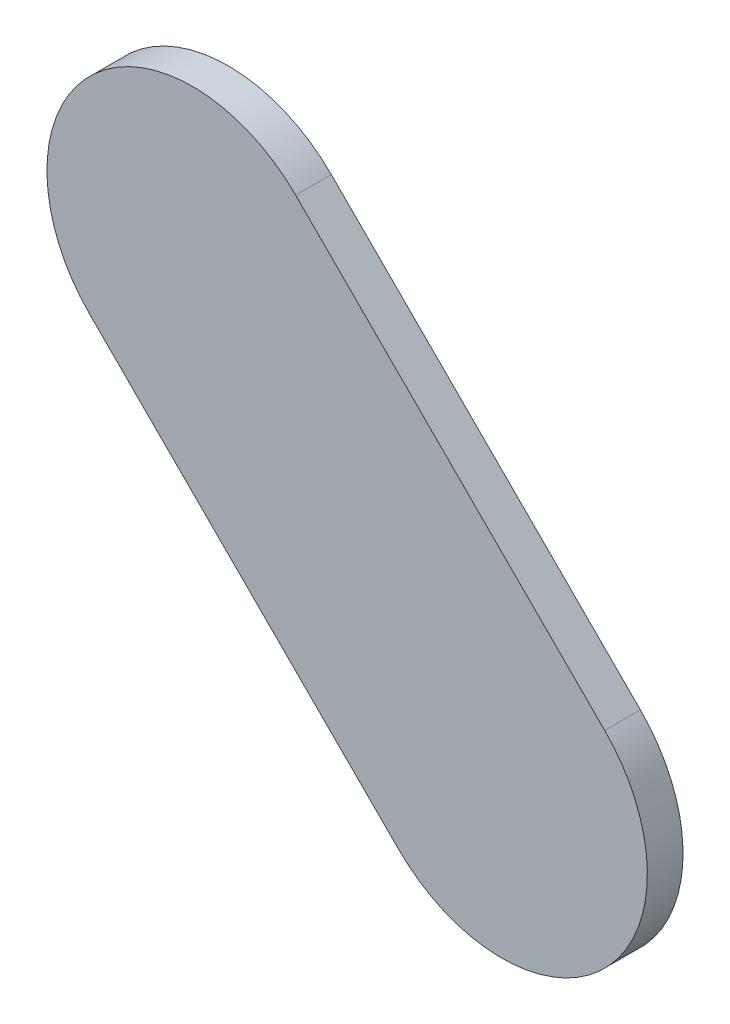
ISO-10303-21;
HEADER;
FILE_DESCRIPTION(('STEP AP214'),'2;1');
FILE_NAME('part.step','',(''),(''),'','','');
FILE_SCHEMA(('AUTOMOTIVE_DESIGN { 1 0 10303 214 1 1 1 1 }'));
ENDSEC;
DATA;
#1=APPLICATION_CONTEXT('core data for automotive mechanical design processes');
#2=APPLICATION_PROTOCOL_DEFINITION('international standard','automotive_design',2000,#1);
#3=PRODUCT_CONTEXT('',#1,'mechanical');
#4=PRODUCT('Part','Part','',(#3));
#5=PRODUCT_RELATED_PRODUCT_CATEGORY('part','',(#4));
#6=PRODUCT_DEFINITION_FORMATION('','',#4);
#7=PRODUCT_DEFINITION_CONTEXT('part definition',#1,'design');
#8=PRODUCT_DEFINITION('design','',#6,#7);
#9=PRODUCT_DEFINITION_SHAPE('','',#8);
#10=(LENGTH_UNIT() NAMED_UNIT(*) SI_UNIT(.MILLI.,.METRE.));
#11=(NAMED_UNIT(*) PLANE_ANGLE_UNIT() SI_UNIT($,.RADIAN.));
#12=(NAMED_UNIT(*) SI_UNIT($,.STERADIAN.) SOLID_ANGLE_UNIT());
#13=UNCERTAINTY_MEASURE_WITH_UNIT(LENGTH_MEASURE(1.E-05),#10,'distance_accuracy_value','');
#14=(GEOMETRIC_REPRESENTATION_CONTEXT(3) GLOBAL_UNCERTAINTY_ASSIGNED_CONTEXT((#13)) GLOBAL_UNIT_ASSIGNED_CONTEXT((#10,
#11,#12)) REPRESENTATION_CONTEXT('',''));
#15=CARTESIAN_POINT('',(0.,0.,0.));
#16=DIRECTION('',(0.,0.,1.));
#17=DIRECTION('',(1.,0.,0.));
#18=AXIS2_PLACEMENT_3D('',#15,#16,#17);
#19=CARTESIAN_POINT('',(8.251412332684,4.567321371874,0.76487));
#20=DIRECTION('',(0.,0.,-1.));
#21=DIRECTION('',(-1.,0.,0.));
#22=AXIS2_PLACEMENT_3D('',#19,#20,#21);
#23=PLANE('',#22);
#24=DIRECTION('',(0.707105988327103,-0.707107574045103,0.));
#25=VECTOR('',#24,1.);
#26=CARTESIAN_POINT('',(8.202021666001,4.814183,0.76487));
#27=LINE('',#26,#25);
#28=CARTESIAN_POINT('',(8.20202169618415,4.81418296981701,0.76487));
#29=VERTEX_POINT('',#28);
#30=CARTESIAN_POINT('',(8.49900622199983,4.51719777799952,0.76487));
#31=VERTEX_POINT('',#30);
#32=EDGE_CURVE('E54',#29,#31,#27,.T.);
#33=ORIENTED_EDGE('',*,*,#32,.T.);
#34=CARTESIAN_POINT('',(8.400011333,4.418202667,0.76487));
#35=DIRECTION('',(0.,0.,1.));
#36=DIRECTION('',(1.,0.,0.));
#37=AXIS2_PLACEMENT_3D('',#34,#35,#36);
#38=CIRCLE('',#37,0.140000071608);
#39=CARTESIAN_POINT('',(8.30101641381825,4.31920825218392,0.76487));
#40=VERTEX_POINT('',#39);
#41=EDGE_CURVE('E20',#40,#31,#38,.T.);
#42=ORIENTED_EDGE('',*,*,#41,.F.);
#43=DIRECTION('',(-0.707107574045603,0.707105988326603,0.));
#44=VECTOR('',#43,1.);
#45=CARTESIAN_POINT('',(8.301016333001,4.319208333001,0.76487));
#46=LINE('',#45,#44);
#47=CARTESIAN_POINT('',(8.00403122200028,4.6161927779999,0.76487));
#48=VERTEX_POINT('',#47);
#49=EDGE_CURVE('E78',#40,#48,#46,.T.);
#50=ORIENTED_EDGE('',*,*,#49,.T.);
#51=CARTESIAN_POINT('',(8.103026,4.715188,0.76487));
#52=DIRECTION('',(0.,0.,1.));
#53=DIRECTION('',(1.,0.,0.));
#54=AXIS2_PLACEMENT_3D('',#51,#52,#53);
#55=CIRCLE('',#54,0.140000071608);
#56=EDGE_CURVE('E58',#29,#48,#55,.T.);
#57=ORIENTED_EDGE('',*,*,#56,.F.);
#58=EDGE_LOOP('',(#33,#42,#50,#57));
#59=FACE_BOUND('',#58,.T.);
#60=ADVANCED_FACE('F17',(#59),#23,.T.);
#61=CARTESIAN_POINT('',(8.400011333,4.418202667,0.76487));
#62=DIRECTION('',(0.,0.,1.));
#63=DIRECTION('',(1.,0.,0.));
#64=AXIS2_PLACEMENT_3D('',#61,#62,#63);
#65=CYLINDRICAL_SURFACE('',#64,0.140000071608);
#66=ORIENTED_EDGE('',*,*,#41,.T.);
#67=DIRECTION('',(0.,0.,1.));
#68=VECTOR('',#67,1.);
#69=CARTESIAN_POINT('',(8.49900599999992,4.51719799999992,0.76487));
#70=LINE('',#69,#68);
#71=CARTESIAN_POINT('',(8.49900622199988,4.51719777799959,0.79916));
#72=VERTEX_POINT('',#71);
#73=EDGE_CURVE('E62',#31,#72,#70,.T.);
#74=ORIENTED_EDGE('',*,*,#73,.T.);
#75=CARTESIAN_POINT('',(8.400011333001,4.418203231733,0.79916));
#76=DIRECTION('',(0.,0.,1.));
#77=DIRECTION('',(1.,0.,0.));
#78=AXIS2_PLACEMENT_3D('',#75,#76,#77);
#79=CIRCLE('',#78,0.14);
#80=CARTESIAN_POINT('',(8.30101641381829,4.31920825218389,0.79916));
#81=VERTEX_POINT('',#80);
#82=EDGE_CURVE('E82',#81,#72,#79,.T.);
#83=ORIENTED_EDGE('',*,*,#82,.F.);
#84=DIRECTION('',(0.,0.,1.));
#85=VECTOR('',#84,1.);
#86=CARTESIAN_POINT('',(8.301016333001,4.319208333001,0.76487));
#87=LINE('',#86,#85);
#88=EDGE_CURVE('E69',#81,#40,#87,.F.);
#89=ORIENTED_EDGE('',*,*,#88,.T.);
#90=EDGE_LOOP('',(#66,#74,#83,#89));
#91=FACE_BOUND('',#90,.T.);
#92=ADVANCED_FACE('F66',(#91),#65,.T.);
#93=CARTESIAN_POINT('',(8.202021666001,4.814183,0.76487));
#94=DIRECTION('',(-0.707107574045103,-0.707105988327103,0.));
#95=DIRECTION('',(0.707105988327103,-0.707107574045103,0.));
#96=AXIS2_PLACEMENT_3D('',#93,#94,#95);
#97=PLANE('',#96);
#98=ORIENTED_EDGE('',*,*,#73,.F.);
#99=ORIENTED_EDGE('',*,*,#32,.F.);
#100=DIRECTION('',(0.,0.,1.));
#101=VECTOR('',#100,1.);
#102=CARTESIAN_POINT('',(8.20202166600123,4.81418300000023,0.76487));
#103=LINE('',#102,#101);
#104=CARTESIAN_POINT('',(8.20202169618413,4.81418296981703,0.79916));
#105=VERTEX_POINT('',#104);
#106=EDGE_CURVE('E73',#105,#29,#103,.F.);
#107=ORIENTED_EDGE('',*,*,#106,.F.);
#108=DIRECTION('',(-0.707105988327285,0.707107574044921,0.));
#109=VECTOR('',#108,1.);
#110=CARTESIAN_POINT('',(8.499006,4.517198,0.79916));
#111=LINE('',#110,#109);
#112=EDGE_CURVE('E72',#72,#105,#111,.T.);
#113=ORIENTED_EDGE('',*,*,#112,.F.);
#114=EDGE_LOOP('',(#98,#99,#107,#113));
#115=FACE_BOUND('',#114,.T.);
#116=ADVANCED_FACE('F71',(#115),#97,.F.);
#117=CARTESIAN_POINT('',(8.103026,4.715188,0.76487));
#118=DIRECTION('',(0.,0.,1.));
#119=DIRECTION('',(1.,0.,0.));
#120=AXIS2_PLACEMENT_3D('',#117,#118,#119);
#121=CYLINDRICAL_SURFACE('',#120,0.140000071608);
#122=ORIENTED_EDGE('',*,*,#56,.T.);
#123=DIRECTION('',(0.,0.,1.));
#124=VECTOR('',#123,1.);
#125=CARTESIAN_POINT('',(8.00403133300021,4.61619266700021,0.76487));
#126=LINE('',#125,#124);
#127=CARTESIAN_POINT('',(8.00403122200016,4.6161927779997,0.79916));
#128=VERTEX_POINT('',#127);
#129=EDGE_CURVE('E79',#48,#128,#126,.T.);
#130=ORIENTED_EDGE('',*,*,#129,.T.);
#131=CARTESIAN_POINT('',(8.103026333,4.715187768268,0.79916));
#132=DIRECTION('',(0.,0.,1.));
#133=DIRECTION('',(1.,0.,0.));
#134=AXIS2_PLACEMENT_3D('',#131,#132,#133);
#135=CIRCLE('',#134,0.140000470934);
#136=EDGE_CURVE('E26',#105,#128,#135,.T.);
#137=ORIENTED_EDGE('',*,*,#136,.F.);
#138=ORIENTED_EDGE('',*,*,#106,.T.);
#139=EDGE_LOOP('',(#122,#130,#137,#138));
#140=FACE_BOUND('',#139,.T.);
#141=ADVANCED_FACE('F91',(#140),#121,.T.);
#142=CARTESIAN_POINT('',(8.301016333001,4.319208333001,0.76487));
#143=DIRECTION('',(0.707105988326603,0.707107574045603,0.));
#144=DIRECTION('',(-0.707107574045603,0.707105988326603,0.));
#145=AXIS2_PLACEMENT_3D('',#142,#143,#144);
#146=PLANE('',#145);
#147=ORIENTED_EDGE('',*,*,#129,.F.);
#148=ORIENTED_EDGE('',*,*,#49,.F.);
#149=ORIENTED_EDGE('',*,*,#88,.F.);
#150=DIRECTION('',(0.707107574046108,-0.707105988326098,0.));
#151=VECTOR('',#150,1.);
#152=CARTESIAN_POINT('',(8.004031333,4.616192667,0.79916));
#153=LINE('',#152,#151);
#154=EDGE_CURVE('E11',#128,#81,#153,.T.);
#155=ORIENTED_EDGE('',*,*,#154,.F.);
#156=EDGE_LOOP('',(#147,#148,#149,#155));
#157=FACE_BOUND('',#156,.T.);
#158=ADVANCED_FACE('F90',(#157),#146,.F.);
#159=CARTESIAN_POINT('',(8.251412332684,4.567321371874,0.79916));
#160=DIRECTION('',(0.,0.,1.));
#161=DIRECTION('',(1.,0.,0.));
#162=AXIS2_PLACEMENT_3D('',#159,#160,#161);
#163=PLANE('',#162);
#164=ORIENTED_EDGE('',*,*,#136,.T.);
#165=ORIENTED_EDGE('',*,*,#154,.T.);
#166=ORIENTED_EDGE('',*,*,#82,.T.);
#167=ORIENTED_EDGE('',*,*,#112,.T.);
#168=EDGE_LOOP('',(#164,#165,#166,#167));
#169=FACE_BOUND('',#168,.T.);
#170=ADVANCED_FACE('F87',(#169),#163,.T.);
#171=CLOSED_SHELL('',(#60,#92,#116,#141,#158,#170));
#172=MANIFOLD_SOLID_BREP('B1',#171);
#173=ADVANCED_BREP_SHAPE_REPRESENTATION('',(#18,#172),#14);
#174=SHAPE_DEFINITION_REPRESENTATION(#9,#173);
ENDSEC;
END-ISO-10303-21;
